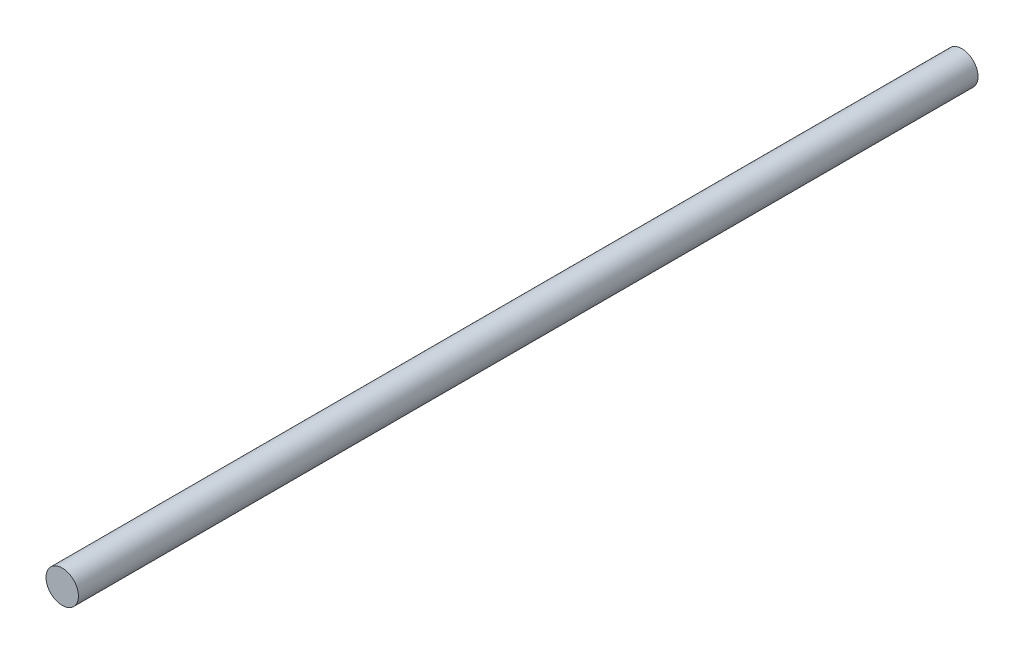
ISO-10303-21;
HEADER;
FILE_DESCRIPTION(('STEP AP214'),'2;1');
FILE_NAME('part.step','',(''),(''),'','','');
FILE_SCHEMA(('AUTOMOTIVE_DESIGN { 1 0 10303 214 1 1 1 1 }'));
ENDSEC;
DATA;
#1=APPLICATION_CONTEXT('core data for automotive mechanical design processes');
#2=APPLICATION_PROTOCOL_DEFINITION('international standard','automotive_design',2000,#1);
#3=PRODUCT_CONTEXT('',#1,'mechanical');
#4=PRODUCT('Part','Part','',(#3));
#5=PRODUCT_RELATED_PRODUCT_CATEGORY('part','',(#4));
#6=PRODUCT_DEFINITION_FORMATION('','',#4);
#7=PRODUCT_DEFINITION_CONTEXT('part definition',#1,'design');
#8=PRODUCT_DEFINITION('design','',#6,#7);
#9=PRODUCT_DEFINITION_SHAPE('','',#8);
#10=(LENGTH_UNIT() NAMED_UNIT(*) SI_UNIT(.MILLI.,.METRE.));
#11=(NAMED_UNIT(*) PLANE_ANGLE_UNIT() SI_UNIT($,.RADIAN.));
#12=(NAMED_UNIT(*) SI_UNIT($,.STERADIAN.) SOLID_ANGLE_UNIT());
#13=UNCERTAINTY_MEASURE_WITH_UNIT(LENGTH_MEASURE(1.E-05),#10,'distance_accuracy_value','');
#14=(GEOMETRIC_REPRESENTATION_CONTEXT(3) GLOBAL_UNCERTAINTY_ASSIGNED_CONTEXT((#13)) GLOBAL_UNIT_ASSIGNED_CONTEXT((#10,
#11,#12)) REPRESENTATION_CONTEXT('',''));
#15=CARTESIAN_POINT('',(0.,0.,0.));
#16=DIRECTION('',(0.,0.,1.));
#17=DIRECTION('',(1.,0.,0.));
#18=AXIS2_PLACEMENT_3D('',#15,#16,#17);
#19=CARTESIAN_POINT('',(0.,0.,277.5));
#20=DIRECTION('',(0.,0.,1.));
#21=DIRECTION('',(1.,0.,0.));
#22=AXIS2_PLACEMENT_3D('',#19,#20,#21);
#23=PLANE('',#22);
#24=CARTESIAN_POINT('',(0.,0.,277.5));
#25=DIRECTION('',(0.,0.,-1.));
#26=DIRECTION('',(-1.,0.,0.));
#27=AXIS2_PLACEMENT_3D('',#24,#25,#26);
#28=CIRCLE('',#27,5.);
#29=CARTESIAN_POINT('',(-5.,0.,277.5));
#30=VERTEX_POINT('',#29);
#31=EDGE_CURVE('E18',#30,#30,#28,.T.);
#32=ORIENTED_EDGE('',*,*,#31,.F.);
#33=EDGE_LOOP('',(#32));
#34=FACE_BOUND('',#33,.T.);
#35=ADVANCED_FACE('F15',(#34),#23,.T.);
#36=CARTESIAN_POINT('',(0.,0.,0.));
#37=DIRECTION('',(0.,0.,1.));
#38=DIRECTION('',(1.,0.,0.));
#39=AXIS2_PLACEMENT_3D('',#36,#37,#38);
#40=PLANE('',#39);
#41=CARTESIAN_POINT('',(0.,0.,0.));
#42=DIRECTION('',(0.,0.,-1.));
#43=DIRECTION('',(-1.,0.,0.));
#44=AXIS2_PLACEMENT_3D('',#41,#42,#43);
#45=CIRCLE('',#44,5.);
#46=CARTESIAN_POINT('',(-5.,0.,0.));
#47=VERTEX_POINT('',#46);
#48=EDGE_CURVE('E10',#47,#47,#45,.F.);
#49=ORIENTED_EDGE('',*,*,#48,.F.);
#50=EDGE_LOOP('',(#49));
#51=FACE_BOUND('',#50,.T.);
#52=ADVANCED_FACE('F30',(#51),#40,.F.);
#53=CARTESIAN_POINT('',(0.,0.,277.5));
#54=DIRECTION('',(0.,0.,-1.));
#55=DIRECTION('',(-1.,0.,0.));
#56=AXIS2_PLACEMENT_3D('',#53,#54,#55);
#57=CYLINDRICAL_SURFACE('',#56,5.);
#58=ORIENTED_EDGE('',*,*,#48,.T.);
#59=EDGE_LOOP('',(#58));
#60=FACE_BOUND('',#59,.T.);
#61=ORIENTED_EDGE('',*,*,#31,.T.);
#62=EDGE_LOOP('',(#61));
#63=FACE_BOUND('',#62,.T.);
#64=ADVANCED_FACE('F27',(#60,#63),#57,.T.);
#65=CLOSED_SHELL('',(#35,#52,#64));
#66=MANIFOLD_SOLID_BREP('B1',#65);
#67=ADVANCED_BREP_SHAPE_REPRESENTATION('',(#18,#66),#14);
#68=SHAPE_DEFINITION_REPRESENTATION(#9,#67);
ENDSEC;
END-ISO-10303-21;
